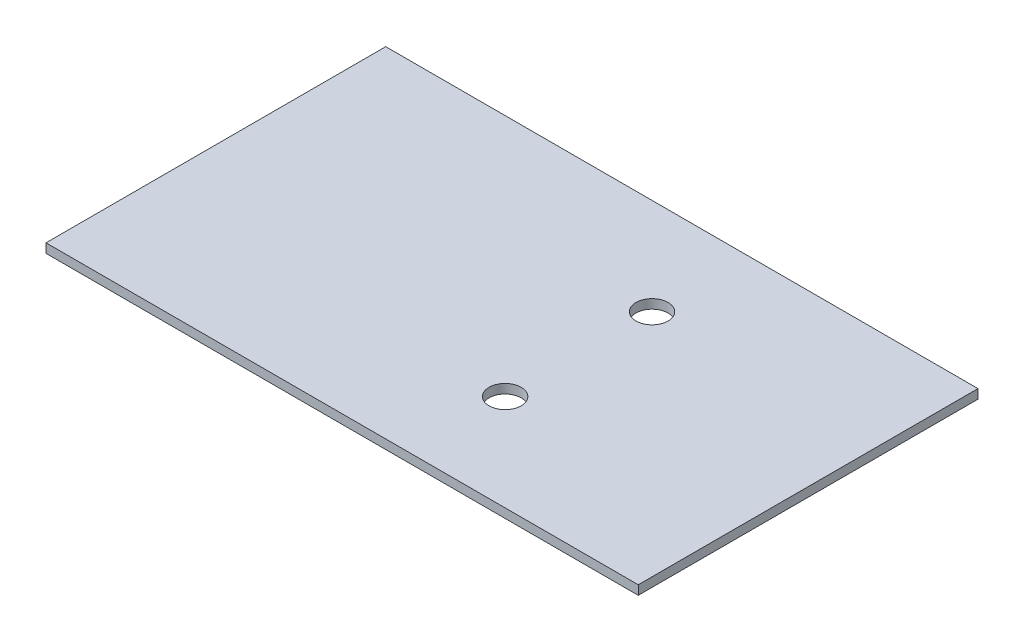
ISO-10303-21;
HEADER;
FILE_DESCRIPTION(('STEP AP214'),'2;1');
FILE_NAME('part.step','',(''),(''),'','','');
FILE_SCHEMA(('AUTOMOTIVE_DESIGN { 1 0 10303 214 1 1 1 1 }'));
ENDSEC;
DATA;
#1=APPLICATION_CONTEXT('core data for automotive mechanical design processes');
#2=APPLICATION_PROTOCOL_DEFINITION('international standard','automotive_design',2000,#1);
#3=PRODUCT_CONTEXT('',#1,'mechanical');
#4=PRODUCT('Part','Part','',(#3));
#5=PRODUCT_RELATED_PRODUCT_CATEGORY('part','',(#4));
#6=PRODUCT_DEFINITION_FORMATION('','',#4);
#7=PRODUCT_DEFINITION_CONTEXT('part definition',#1,'design');
#8=PRODUCT_DEFINITION('design','',#6,#7);
#9=PRODUCT_DEFINITION_SHAPE('','',#8);
#10=(LENGTH_UNIT() NAMED_UNIT(*) SI_UNIT(.MILLI.,.METRE.));
#11=(NAMED_UNIT(*) PLANE_ANGLE_UNIT() SI_UNIT($,.RADIAN.));
#12=(NAMED_UNIT(*) SI_UNIT($,.STERADIAN.) SOLID_ANGLE_UNIT());
#13=UNCERTAINTY_MEASURE_WITH_UNIT(LENGTH_MEASURE(1.E-05),#10,'distance_accuracy_value','');
#14=(GEOMETRIC_REPRESENTATION_CONTEXT(3) GLOBAL_UNCERTAINTY_ASSIGNED_CONTEXT((#13)) GLOBAL_UNIT_ASSIGNED_CONTEXT((#10,
#11,#12)) REPRESENTATION_CONTEXT('',''));
#15=CARTESIAN_POINT('',(0.,0.,0.));
#16=DIRECTION('',(0.,0.,1.));
#17=DIRECTION('',(1.,0.,0.));
#18=AXIS2_PLACEMENT_3D('',#15,#16,#17);
#19=CARTESIAN_POINT('',(0.,2.,0.));
#20=DIRECTION('',(1.,0.,0.));
#21=DIRECTION('',(0.,0.,-1.));
#22=AXIS2_PLACEMENT_3D('',#19,#20,#21);
#23=PLANE('',#22);
#24=DIRECTION('',(0.,0.,1.));
#25=VECTOR('',#24,1.);
#26=CARTESIAN_POINT('',(0.,0.,0.));
#27=LINE('',#26,#25);
#28=CARTESIAN_POINT('',(0.,0.,0.));
#29=VERTEX_POINT('',#28);
#30=CARTESIAN_POINT('',(0.,0.,74.));
#31=VERTEX_POINT('',#30);
#32=EDGE_CURVE('E100',#29,#31,#27,.T.);
#33=ORIENTED_EDGE('',*,*,#32,.T.);
#34=DIRECTION('',(0.,-1.,0.));
#35=VECTOR('',#34,1.);
#36=CARTESIAN_POINT('',(0.,2.,74.));
#37=LINE('',#36,#35);
#38=CARTESIAN_POINT('',(0.,2.,74.));
#39=VERTEX_POINT('',#38);
#40=EDGE_CURVE('E12',#39,#31,#37,.T.);
#41=ORIENTED_EDGE('',*,*,#40,.F.);
#42=DIRECTION('',(0.,0.,1.));
#43=VECTOR('',#42,1.);
#44=CARTESIAN_POINT('',(0.,2.,0.));
#45=LINE('',#44,#43);
#46=CARTESIAN_POINT('',(0.,2.,0.));
#47=VERTEX_POINT('',#46);
#48=EDGE_CURVE('E88',#47,#39,#45,.T.);
#49=ORIENTED_EDGE('',*,*,#48,.F.);
#50=DIRECTION('',(0.,-1.,0.));
#51=VECTOR('',#50,1.);
#52=CARTESIAN_POINT('',(0.,2.,0.));
#53=LINE('',#52,#51);
#54=EDGE_CURVE('E96',#47,#29,#53,.T.);
#55=ORIENTED_EDGE('',*,*,#54,.T.);
#56=EDGE_LOOP('',(#33,#41,#49,#55));
#57=FACE_BOUND('',#56,.T.);
#58=ADVANCED_FACE('F37',(#57),#23,.F.);
#59=CARTESIAN_POINT('',(0.,2.,74.));
#60=DIRECTION('',(0.,0.,-1.));
#61=DIRECTION('',(-1.,0.,0.));
#62=AXIS2_PLACEMENT_3D('',#59,#60,#61);
#63=PLANE('',#62);
#64=DIRECTION('',(1.,0.,0.));
#65=VECTOR('',#64,1.);
#66=CARTESIAN_POINT('',(0.,0.,74.));
#67=LINE('',#66,#65);
#68=CARTESIAN_POINT('',(129.,0.,74.));
#69=VERTEX_POINT('',#68);
#70=EDGE_CURVE('E92',#31,#69,#67,.T.);
#71=ORIENTED_EDGE('',*,*,#70,.T.);
#72=DIRECTION('',(0.,-1.,0.));
#73=VECTOR('',#72,1.);
#74=CARTESIAN_POINT('',(129.,2.,74.));
#75=LINE('',#74,#73);
#76=CARTESIAN_POINT('',(129.,2.,74.));
#77=VERTEX_POINT('',#76);
#78=EDGE_CURVE('E45',#77,#69,#75,.T.);
#79=ORIENTED_EDGE('',*,*,#78,.F.);
#80=DIRECTION('',(1.,0.,0.));
#81=VECTOR('',#80,1.);
#82=CARTESIAN_POINT('',(0.,2.,74.));
#83=LINE('',#82,#81);
#84=EDGE_CURVE('E83',#39,#77,#83,.T.);
#85=ORIENTED_EDGE('',*,*,#84,.F.);
#86=ORIENTED_EDGE('',*,*,#40,.T.);
#87=EDGE_LOOP('',(#71,#79,#85,#86));
#88=FACE_BOUND('',#87,.T.);
#89=ADVANCED_FACE('F91',(#88),#63,.F.);
#90=CARTESIAN_POINT('',(129.,2.,0.));
#91=DIRECTION('',(-1.,0.,0.));
#92=DIRECTION('',(0.,0.,1.));
#93=AXIS2_PLACEMENT_3D('',#90,#91,#92);
#94=PLANE('',#93);
#95=DIRECTION('',(0.,0.,-1.));
#96=VECTOR('',#95,1.);
#97=CARTESIAN_POINT('',(129.,0.,0.));
#98=LINE('',#97,#96);
#99=CARTESIAN_POINT('',(129.,0.,0.));
#100=VERTEX_POINT('',#99);
#101=EDGE_CURVE('E70',#69,#100,#98,.T.);
#102=ORIENTED_EDGE('',*,*,#101,.T.);
#103=DIRECTION('',(0.,-1.,0.));
#104=VECTOR('',#103,1.);
#105=CARTESIAN_POINT('',(129.,2.,0.));
#106=LINE('',#105,#104);
#107=CARTESIAN_POINT('',(129.,2.,0.));
#108=VERTEX_POINT('',#107);
#109=EDGE_CURVE('E93',#108,#100,#106,.T.);
#110=ORIENTED_EDGE('',*,*,#109,.F.);
#111=DIRECTION('',(0.,0.,-1.));
#112=VECTOR('',#111,1.);
#113=CARTESIAN_POINT('',(129.,2.,0.));
#114=LINE('',#113,#112);
#115=EDGE_CURVE('E86',#77,#108,#114,.T.);
#116=ORIENTED_EDGE('',*,*,#115,.F.);
#117=ORIENTED_EDGE('',*,*,#78,.T.);
#118=EDGE_LOOP('',(#102,#110,#116,#117));
#119=FACE_BOUND('',#118,.T.);
#120=ADVANCED_FACE('F94',(#119),#94,.F.);
#121=CARTESIAN_POINT('',(0.,2.,0.));
#122=DIRECTION('',(0.,0.,1.));
#123=DIRECTION('',(1.,0.,0.));
#124=AXIS2_PLACEMENT_3D('',#121,#122,#123);
#125=PLANE('',#124);
#126=DIRECTION('',(-1.,0.,0.));
#127=VECTOR('',#126,1.);
#128=CARTESIAN_POINT('',(0.,0.,0.));
#129=LINE('',#128,#127);
#130=EDGE_CURVE('E76',#100,#29,#129,.T.);
#131=ORIENTED_EDGE('',*,*,#130,.T.);
#132=ORIENTED_EDGE('',*,*,#54,.F.);
#133=DIRECTION('',(-1.,0.,0.));
#134=VECTOR('',#133,1.);
#135=CARTESIAN_POINT('',(0.,2.,0.));
#136=LINE('',#135,#134);
#137=EDGE_CURVE('E53',#108,#47,#136,.T.);
#138=ORIENTED_EDGE('',*,*,#137,.F.);
#139=ORIENTED_EDGE('',*,*,#109,.T.);
#140=EDGE_LOOP('',(#131,#132,#138,#139));
#141=FACE_BOUND('',#140,.T.);
#142=ADVANCED_FACE('F118',(#141),#125,.F.);
#143=CARTESIAN_POINT('',(0.,2.,0.));
#144=DIRECTION('',(0.,1.,0.));
#145=DIRECTION('',(0.,0.,1.));
#146=AXIS2_PLACEMENT_3D('',#143,#144,#145);
#147=PLANE('',#146);
#148=CARTESIAN_POINT('',(78.9999999999999,2.,21.0000000000014));
#149=DIRECTION('',(0.,-1.,0.));
#150=DIRECTION('',(0.,0.,-1.));
#151=AXIS2_PLACEMENT_3D('',#148,#149,#150);
#152=CIRCLE('',#151,3.50000000000001);
#153=CARTESIAN_POINT('',(78.9999999999999,2.,17.5000000000014));
#154=VERTEX_POINT('',#153);
#155=EDGE_CURVE('E104',#154,#154,#152,.T.);
#156=ORIENTED_EDGE('',*,*,#155,.T.);
#157=EDGE_LOOP('',(#156));
#158=FACE_BOUND('',#157,.T.);
#159=CARTESIAN_POINT('',(78.9999999999999,2.,53.000000000002));
#160=DIRECTION('',(0.,-1.,0.));
#161=DIRECTION('',(0.,0.,-1.));
#162=AXIS2_PLACEMENT_3D('',#159,#160,#161);
#163=CIRCLE('',#162,3.50000000000001);
#164=CARTESIAN_POINT('',(78.9999999999999,2.,49.500000000002));
#165=VERTEX_POINT('',#164);
#166=EDGE_CURVE('E128',#165,#165,#163,.T.);
#167=ORIENTED_EDGE('',*,*,#166,.T.);
#168=EDGE_LOOP('',(#167));
#169=FACE_BOUND('',#168,.T.);
#170=ORIENTED_EDGE('',*,*,#48,.T.);
#171=ORIENTED_EDGE('',*,*,#84,.T.);
#172=ORIENTED_EDGE('',*,*,#115,.T.);
#173=ORIENTED_EDGE('',*,*,#137,.T.);
#174=EDGE_LOOP('',(#170,#171,#172,#173));
#175=FACE_BOUND('',#174,.T.);
#176=ADVANCED_FACE('F84',(#158,#169,#175),#147,.T.);
#177=CARTESIAN_POINT('',(0.,0.,0.));
#178=DIRECTION('',(0.,1.,0.));
#179=DIRECTION('',(0.,0.,1.));
#180=AXIS2_PLACEMENT_3D('',#177,#178,#179);
#181=PLANE('',#180);
#182=CARTESIAN_POINT('',(78.9999999999999,0.,21.0000000000014));
#183=DIRECTION('',(0.,-1.,0.));
#184=DIRECTION('',(0.,0.,-1.));
#185=AXIS2_PLACEMENT_3D('',#182,#183,#184);
#186=CIRCLE('',#185,3.50000000000001);
#187=CARTESIAN_POINT('',(78.9999999999999,0.,17.5000000000014));
#188=VERTEX_POINT('',#187);
#189=EDGE_CURVE('E131',#188,#188,#186,.T.);
#190=ORIENTED_EDGE('',*,*,#189,.F.);
#191=EDGE_LOOP('',(#190));
#192=FACE_BOUND('',#191,.T.);
#193=CARTESIAN_POINT('',(78.9999999999999,0.,53.000000000002));
#194=DIRECTION('',(0.,-1.,0.));
#195=DIRECTION('',(0.,0.,-1.));
#196=AXIS2_PLACEMENT_3D('',#193,#194,#195);
#197=CIRCLE('',#196,3.50000000000001);
#198=CARTESIAN_POINT('',(78.9999999999999,0.,49.500000000002));
#199=VERTEX_POINT('',#198);
#200=EDGE_CURVE('E123',#199,#199,#197,.T.);
#201=ORIENTED_EDGE('',*,*,#200,.F.);
#202=EDGE_LOOP('',(#201));
#203=FACE_BOUND('',#202,.T.);
#204=ORIENTED_EDGE('',*,*,#32,.F.);
#205=ORIENTED_EDGE('',*,*,#130,.F.);
#206=ORIENTED_EDGE('',*,*,#101,.F.);
#207=ORIENTED_EDGE('',*,*,#70,.F.);
#208=EDGE_LOOP('',(#204,#205,#206,#207));
#209=FACE_BOUND('',#208,.T.);
#210=ADVANCED_FACE('F121',(#192,#203,#209),#181,.F.);
#211=CARTESIAN_POINT('',(78.9999999999999,2.,53.000000000002));
#212=DIRECTION('',(0.,-1.,0.));
#213=DIRECTION('',(0.,0.,-1.));
#214=AXIS2_PLACEMENT_3D('',#211,#212,#213);
#215=CYLINDRICAL_SURFACE('',#214,3.50000000000001);
#216=ORIENTED_EDGE('',*,*,#166,.F.);
#217=EDGE_LOOP('',(#216));
#218=FACE_BOUND('',#217,.T.);
#219=ORIENTED_EDGE('',*,*,#200,.T.);
#220=EDGE_LOOP('',(#219));
#221=FACE_BOUND('',#220,.T.);
#222=ADVANCED_FACE('F144',(#218,#221),#215,.F.);
#223=CARTESIAN_POINT('',(78.9999999999999,2.,21.0000000000014));
#224=DIRECTION('',(0.,-1.,0.));
#225=DIRECTION('',(0.,0.,-1.));
#226=AXIS2_PLACEMENT_3D('',#223,#224,#225);
#227=CYLINDRICAL_SURFACE('',#226,3.50000000000001);
#228=ORIENTED_EDGE('',*,*,#155,.F.);
#229=EDGE_LOOP('',(#228));
#230=FACE_BOUND('',#229,.T.);
#231=ORIENTED_EDGE('',*,*,#189,.T.);
#232=EDGE_LOOP('',(#231));
#233=FACE_BOUND('',#232,.T.);
#234=ADVANCED_FACE('F141',(#230,#233),#227,.F.);
#235=CLOSED_SHELL('',(#58,#89,#120,#142,#176,#210,#222,#234));
#236=MANIFOLD_SOLID_BREP('B2',#235);
#237=ADVANCED_BREP_SHAPE_REPRESENTATION('',(#18,#236),#14);
#238=SHAPE_DEFINITION_REPRESENTATION(#9,#237);
ENDSEC;
END-ISO-10303-21;
